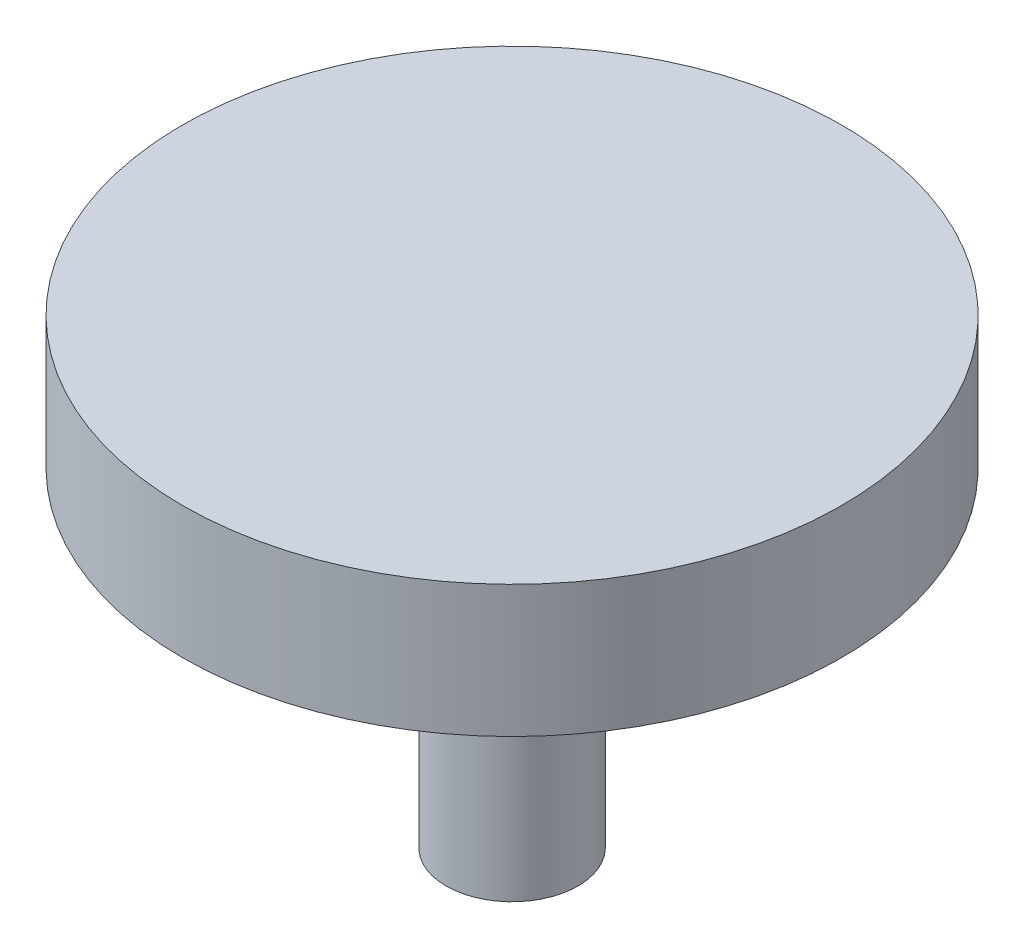
ISO-10303-21;
HEADER;
FILE_DESCRIPTION(('STEP AP214'),'2;1');
FILE_NAME('part.step','',(''),(''),'','','');
FILE_SCHEMA(('AUTOMOTIVE_DESIGN { 1 0 10303 214 1 1 1 1 }'));
ENDSEC;
DATA;
#1=APPLICATION_CONTEXT('core data for automotive mechanical design processes');
#2=APPLICATION_PROTOCOL_DEFINITION('international standard','automotive_design',2000,#1);
#3=PRODUCT_CONTEXT('',#1,'mechanical');
#4=PRODUCT('Part','Part','',(#3));
#5=PRODUCT_RELATED_PRODUCT_CATEGORY('part','',(#4));
#6=PRODUCT_DEFINITION_FORMATION('','',#4);
#7=PRODUCT_DEFINITION_CONTEXT('part definition',#1,'design');
#8=PRODUCT_DEFINITION('design','',#6,#7);
#9=PRODUCT_DEFINITION_SHAPE('','',#8);
#10=(LENGTH_UNIT() NAMED_UNIT(*) SI_UNIT(.MILLI.,.METRE.));
#11=(NAMED_UNIT(*) PLANE_ANGLE_UNIT() SI_UNIT($,.RADIAN.));
#12=(NAMED_UNIT(*) SI_UNIT($,.STERADIAN.) SOLID_ANGLE_UNIT());
#13=UNCERTAINTY_MEASURE_WITH_UNIT(LENGTH_MEASURE(1.E-05),#10,'distance_accuracy_value','');
#14=(GEOMETRIC_REPRESENTATION_CONTEXT(3) GLOBAL_UNCERTAINTY_ASSIGNED_CONTEXT((#13)) GLOBAL_UNIT_ASSIGNED_CONTEXT((#10,
#11,#12)) REPRESENTATION_CONTEXT('',''));
#15=CARTESIAN_POINT('',(0.,0.,0.));
#16=DIRECTION('',(0.,0.,1.));
#17=DIRECTION('',(1.,0.,0.));
#18=AXIS2_PLACEMENT_3D('',#15,#16,#17);
#19=CARTESIAN_POINT('',(0.,10.,0.));
#20=DIRECTION('',(0.,-1.,0.));
#21=DIRECTION('',(0.,0.,-1.));
#22=AXIS2_PLACEMENT_3D('',#19,#20,#21);
#23=CYLINDRICAL_SURFACE('',#22,25.);
#24=CARTESIAN_POINT('',(0.,10.,0.));
#25=DIRECTION('',(0.,1.,0.));
#26=DIRECTION('',(0.,0.,1.));
#27=AXIS2_PLACEMENT_3D('',#24,#25,#26);
#28=CIRCLE('',#27,25.);
#29=CARTESIAN_POINT('',(0.,10.,25.));
#30=VERTEX_POINT('',#29);
#31=EDGE_CURVE('E10',#30,#30,#28,.T.);
#32=ORIENTED_EDGE('',*,*,#31,.F.);
#33=EDGE_LOOP('',(#32));
#34=FACE_BOUND('',#33,.T.);
#35=CARTESIAN_POINT('',(0.,0.,0.));
#36=DIRECTION('',(0.,1.,0.));
#37=DIRECTION('',(0.,0.,1.));
#38=AXIS2_PLACEMENT_3D('',#35,#36,#37);
#39=CIRCLE('',#38,25.);
#40=CARTESIAN_POINT('',(0.,0.,25.));
#41=VERTEX_POINT('',#40);
#42=EDGE_CURVE('E41',#41,#41,#39,.T.);
#43=ORIENTED_EDGE('',*,*,#42,.T.);
#44=EDGE_LOOP('',(#43));
#45=FACE_BOUND('',#44,.T.);
#46=ADVANCED_FACE('F38',(#34,#45),#23,.T.);
#47=CARTESIAN_POINT('',(0.,10.,0.));
#48=DIRECTION('',(0.,1.,0.));
#49=DIRECTION('',(0.,0.,1.));
#50=AXIS2_PLACEMENT_3D('',#47,#48,#49);
#51=PLANE('',#50);
#52=ORIENTED_EDGE('',*,*,#31,.T.);
#53=EDGE_LOOP('',(#52));
#54=FACE_BOUND('',#53,.T.);
#55=ADVANCED_FACE('F68',(#54),#51,.T.);
#56=CARTESIAN_POINT('',(0.,0.,0.));
#57=DIRECTION('',(0.,1.,0.));
#58=DIRECTION('',(0.,0.,1.));
#59=AXIS2_PLACEMENT_3D('',#56,#57,#58);
#60=PLANE('',#59);
#61=CARTESIAN_POINT('',(0.,0.,0.));
#62=DIRECTION('',(0.,1.,0.));
#63=DIRECTION('',(0.,0.,1.));
#64=AXIS2_PLACEMENT_3D('',#61,#62,#63);
#65=CIRCLE('',#64,5.);
#66=CARTESIAN_POINT('',(0.,0.,5.));
#67=VERTEX_POINT('',#66);
#68=EDGE_CURVE('E50',#67,#67,#65,.T.);
#69=ORIENTED_EDGE('',*,*,#68,.T.);
#70=EDGE_LOOP('',(#69));
#71=FACE_BOUND('',#70,.T.);
#72=ORIENTED_EDGE('',*,*,#42,.F.);
#73=EDGE_LOOP('',(#72));
#74=FACE_BOUND('',#73,.T.);
#75=ADVANCED_FACE('F65',(#71,#74),#60,.F.);
#76=CARTESIAN_POINT('',(0.,-25.,0.));
#77=DIRECTION('',(0.,1.,0.));
#78=DIRECTION('',(0.,0.,1.));
#79=AXIS2_PLACEMENT_3D('',#76,#77,#78);
#80=CYLINDRICAL_SURFACE('',#79,5.);
#81=CARTESIAN_POINT('',(0.,-25.,0.));
#82=DIRECTION('',(0.,1.,0.));
#83=DIRECTION('',(0.,0.,1.));
#84=AXIS2_PLACEMENT_3D('',#81,#82,#83);
#85=CIRCLE('',#84,5.);
#86=CARTESIAN_POINT('',(0.,-25.,5.));
#87=VERTEX_POINT('',#86);
#88=EDGE_CURVE('E48',#87,#87,#85,.T.);
#89=ORIENTED_EDGE('',*,*,#88,.T.);
#90=EDGE_LOOP('',(#89));
#91=FACE_BOUND('',#90,.T.);
#92=ORIENTED_EDGE('',*,*,#68,.F.);
#93=EDGE_LOOP('',(#92));
#94=FACE_BOUND('',#93,.T.);
#95=ADVANCED_FACE('F56',(#91,#94),#80,.T.);
#96=CARTESIAN_POINT('',(0.,-25.,0.));
#97=DIRECTION('',(0.,1.,0.));
#98=DIRECTION('',(0.,0.,1.));
#99=AXIS2_PLACEMENT_3D('',#96,#97,#98);
#100=PLANE('',#99);
#101=ORIENTED_EDGE('',*,*,#88,.F.);
#102=EDGE_LOOP('',(#101));
#103=FACE_BOUND('',#102,.T.);
#104=ADVANCED_FACE('F59',(#103),#100,.F.);
#105=CLOSED_SHELL('',(#46,#55,#75,#95,#104));
#106=MANIFOLD_SOLID_BREP('B2',#105);
#107=ADVANCED_BREP_SHAPE_REPRESENTATION('',(#18,#106),#14);
#108=SHAPE_DEFINITION_REPRESENTATION(#9,#107);
ENDSEC;
END-ISO-10303-21;
